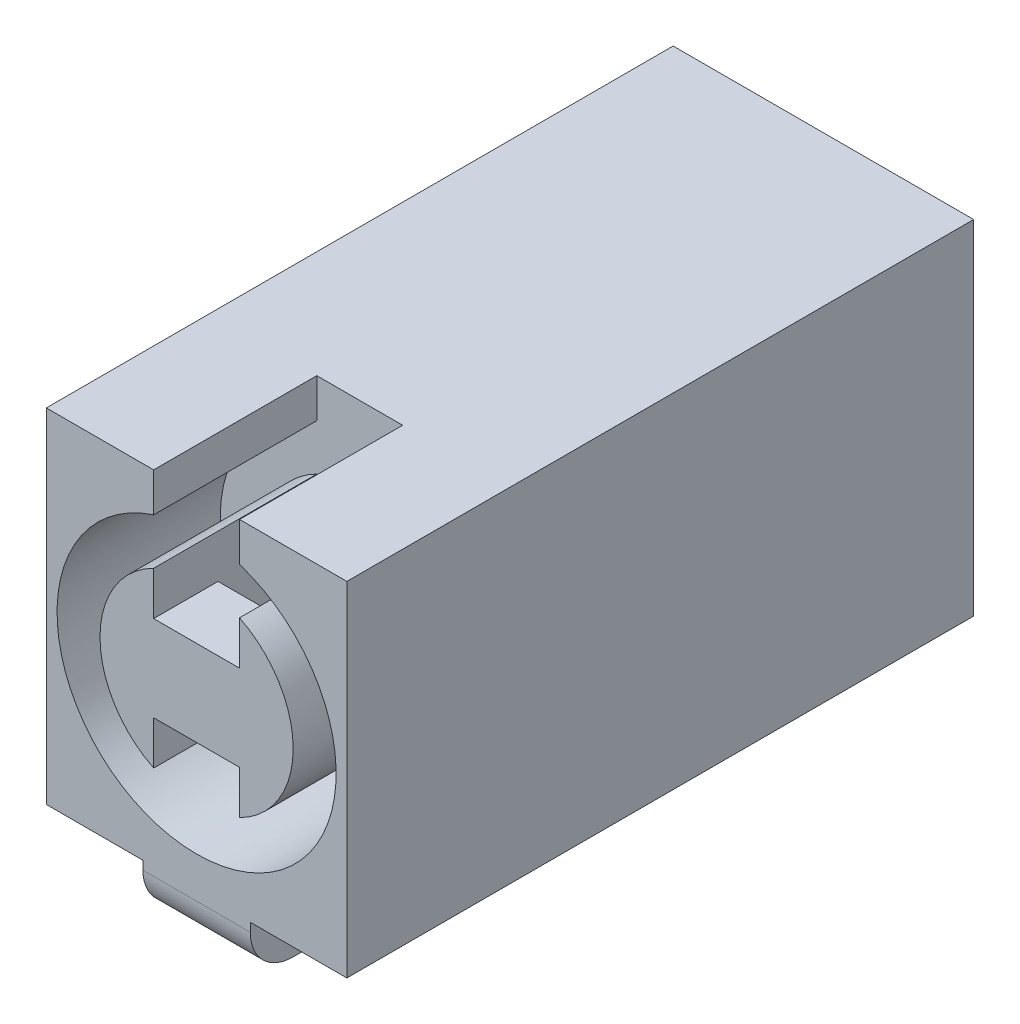
ISO-10303-21;
HEADER;
FILE_DESCRIPTION(('STEP AP214'),'2;1');
FILE_NAME('part.step','',(''),(''),'','','');
FILE_SCHEMA(('AUTOMOTIVE_DESIGN { 1 0 10303 214 1 1 1 1 }'));
ENDSEC;
DATA;
#1=APPLICATION_CONTEXT('core data for automotive mechanical design processes');
#2=APPLICATION_PROTOCOL_DEFINITION('international standard','automotive_design',2000,#1);
#3=PRODUCT_CONTEXT('',#1,'mechanical');
#4=PRODUCT('Part','Part','',(#3));
#5=PRODUCT_RELATED_PRODUCT_CATEGORY('part','',(#4));
#6=PRODUCT_DEFINITION_FORMATION('','',#4);
#7=PRODUCT_DEFINITION_CONTEXT('part definition',#1,'design');
#8=PRODUCT_DEFINITION('design','',#6,#7);
#9=PRODUCT_DEFINITION_SHAPE('','',#8);
#10=(LENGTH_UNIT() NAMED_UNIT(*) SI_UNIT(.MILLI.,.METRE.));
#11=(NAMED_UNIT(*) PLANE_ANGLE_UNIT() SI_UNIT($,.RADIAN.));
#12=(NAMED_UNIT(*) SI_UNIT($,.STERADIAN.) SOLID_ANGLE_UNIT());
#13=UNCERTAINTY_MEASURE_WITH_UNIT(LENGTH_MEASURE(1.E-05),#10,'distance_accuracy_value','');
#14=(GEOMETRIC_REPRESENTATION_CONTEXT(3) GLOBAL_UNCERTAINTY_ASSIGNED_CONTEXT((#13)) GLOBAL_UNIT_ASSIGNED_CONTEXT((#10,
#11,#12)) REPRESENTATION_CONTEXT('',''));
#15=CARTESIAN_POINT('',(0.,0.,0.));
#16=DIRECTION('',(0.,0.,1.));
#17=DIRECTION('',(1.,0.,0.));
#18=AXIS2_PLACEMENT_3D('',#15,#16,#17);
#19=CARTESIAN_POINT('',(2.5,3.5,-9.8));
#20=DIRECTION('',(-1.,0.,0.));
#21=DIRECTION('',(0.,0.,1.));
#22=AXIS2_PLACEMENT_3D('',#19,#20,#21);
#23=PLANE('',#22);
#24=DIRECTION('',(0.,1.,0.));
#25=VECTOR('',#24,1.);
#26=CARTESIAN_POINT('',(2.5,2.5,-7.8));
#27=LINE('',#26,#25);
#28=CARTESIAN_POINT('',(2.5,2.5,-7.8));
#29=VERTEX_POINT('',#28);
#30=CARTESIAN_POINT('',(2.5,3.5,-7.8));
#31=VERTEX_POINT('',#30);
#32=EDGE_CURVE('E498',#29,#31,#27,.T.);
#33=ORIENTED_EDGE('',*,*,#32,.F.);
#34=DIRECTION('',(0.,0.,-1.));
#35=VECTOR('',#34,1.);
#36=CARTESIAN_POINT('',(2.5,2.5,-7.8));
#37=LINE('',#36,#35);
#38=CARTESIAN_POINT('',(2.5,2.5,-6.8));
#39=VERTEX_POINT('',#38);
#40=EDGE_CURVE('E558',#39,#29,#37,.T.);
#41=ORIENTED_EDGE('',*,*,#40,.F.);
#42=DIRECTION('',(0.,1.,0.));
#43=VECTOR('',#42,1.);
#44=CARTESIAN_POINT('',(2.5,2.5,-6.8));
#45=LINE('',#44,#43);
#46=CARTESIAN_POINT('',(2.5,3.5,-6.8));
#47=VERTEX_POINT('',#46);
#48=EDGE_CURVE('E551',#39,#47,#45,.T.);
#49=ORIENTED_EDGE('',*,*,#48,.T.);
#50=DIRECTION('',(0.,0.,-1.));
#51=VECTOR('',#50,1.);
#52=CARTESIAN_POINT('',(2.5,3.5,-9.8));
#53=LINE('',#52,#51);
#54=CARTESIAN_POINT('',(2.5,3.5,-4.8));
#55=VERTEX_POINT('',#54);
#56=EDGE_CURVE('E440',#55,#47,#53,.T.);
#57=ORIENTED_EDGE('',*,*,#56,.F.);
#58=DIRECTION('',(0.,-1.,0.));
#59=VECTOR('',#58,1.);
#60=CARTESIAN_POINT('',(2.5,3.5,-4.8));
#61=LINE('',#60,#59);
#62=CARTESIAN_POINT('',(2.5,0.,-4.8));
#63=VERTEX_POINT('',#62);
#64=EDGE_CURVE('E299',#55,#63,#61,.T.);
#65=ORIENTED_EDGE('',*,*,#64,.T.);
#66=DIRECTION('',(0.,0.,-1.));
#67=VECTOR('',#66,1.);
#68=CARTESIAN_POINT('',(2.5,0.,-9.8));
#69=LINE('',#68,#67);
#70=CARTESIAN_POINT('',(2.5,0.,-9.8));
#71=VERTEX_POINT('',#70);
#72=EDGE_CURVE('E435',#63,#71,#69,.T.);
#73=ORIENTED_EDGE('',*,*,#72,.T.);
#74=DIRECTION('',(0.,-1.,0.));
#75=VECTOR('',#74,1.);
#76=CARTESIAN_POINT('',(2.5,3.5,-9.8));
#77=LINE('',#76,#75);
#78=CARTESIAN_POINT('',(2.5,3.5,-9.8));
#79=VERTEX_POINT('',#78);
#80=EDGE_CURVE('E453',#79,#71,#77,.T.);
#81=ORIENTED_EDGE('',*,*,#80,.F.);
#82=EDGE_CURVE('E443',#31,#79,#53,.T.);
#83=ORIENTED_EDGE('',*,*,#82,.F.);
#84=EDGE_LOOP('',(#33,#41,#49,#57,#65,#73,#81,#83));
#85=FACE_BOUND('',#84,.T.);
#86=ADVANCED_FACE('F38',(#85),#23,.F.);
#87=CARTESIAN_POINT('',(4.5,3.5,-9.8));
#88=DIRECTION('',(1.,0.,0.));
#89=DIRECTION('',(0.,0.,-1.));
#90=AXIS2_PLACEMENT_3D('',#87,#88,#89);
#91=PLANE('',#90);
#92=DIRECTION('',(0.,1.,0.));
#93=VECTOR('',#92,1.);
#94=CARTESIAN_POINT('',(4.5,2.5,-7.8));
#95=LINE('',#94,#93);
#96=CARTESIAN_POINT('',(4.5,2.5,-7.8));
#97=VERTEX_POINT('',#96);
#98=CARTESIAN_POINT('',(4.5,3.5,-7.8));
#99=VERTEX_POINT('',#98);
#100=EDGE_CURVE('E501',#97,#99,#95,.T.);
#101=ORIENTED_EDGE('',*,*,#100,.T.);
#102=DIRECTION('',(0.,0.,1.));
#103=VECTOR('',#102,1.);
#104=CARTESIAN_POINT('',(4.5,3.5,-9.8));
#105=LINE('',#104,#103);
#106=CARTESIAN_POINT('',(4.5,3.5,-9.8));
#107=VERTEX_POINT('',#106);
#108=EDGE_CURVE('E447',#107,#99,#105,.T.);
#109=ORIENTED_EDGE('',*,*,#108,.F.);
#110=DIRECTION('',(0.,-1.,0.));
#111=VECTOR('',#110,1.);
#112=CARTESIAN_POINT('',(4.5,3.5,-9.8));
#113=LINE('',#112,#111);
#114=CARTESIAN_POINT('',(4.5,0.,-9.8));
#115=VERTEX_POINT('',#114);
#116=EDGE_CURVE('E463',#107,#115,#113,.T.);
#117=ORIENTED_EDGE('',*,*,#116,.T.);
#118=DIRECTION('',(0.,0.,1.));
#119=VECTOR('',#118,1.);
#120=CARTESIAN_POINT('',(4.5,0.,-9.8));
#121=LINE('',#120,#119);
#122=CARTESIAN_POINT('',(4.5,0.,-4.8));
#123=VERTEX_POINT('',#122);
#124=EDGE_CURVE('E456',#115,#123,#121,.T.);
#125=ORIENTED_EDGE('',*,*,#124,.T.);
#126=DIRECTION('',(0.,-1.,0.));
#127=VECTOR('',#126,1.);
#128=CARTESIAN_POINT('',(4.5,3.5,-4.8));
#129=LINE('',#128,#127);
#130=CARTESIAN_POINT('',(4.5,3.5,-4.8));
#131=VERTEX_POINT('',#130);
#132=EDGE_CURVE('E460',#131,#123,#129,.T.);
#133=ORIENTED_EDGE('',*,*,#132,.F.);
#134=CARTESIAN_POINT('',(4.5,3.5,-6.8));
#135=VERTEX_POINT('',#134);
#136=EDGE_CURVE('E446',#135,#131,#105,.T.);
#137=ORIENTED_EDGE('',*,*,#136,.F.);
#138=DIRECTION('',(0.,1.,0.));
#139=VECTOR('',#138,1.);
#140=CARTESIAN_POINT('',(4.5,2.5,-6.8));
#141=LINE('',#140,#139);
#142=CARTESIAN_POINT('',(4.5,2.5,-6.8));
#143=VERTEX_POINT('',#142);
#144=EDGE_CURVE('E548',#143,#135,#141,.T.);
#145=ORIENTED_EDGE('',*,*,#144,.F.);
#146=DIRECTION('',(0.,0.,1.));
#147=VECTOR('',#146,1.);
#148=CARTESIAN_POINT('',(4.5,2.5,-7.8));
#149=LINE('',#148,#147);
#150=EDGE_CURVE('E565',#97,#143,#149,.T.);
#151=ORIENTED_EDGE('',*,*,#150,.F.);
#152=EDGE_LOOP('',(#101,#109,#117,#125,#133,#137,#145,#151));
#153=FACE_BOUND('',#152,.T.);
#154=ADVANCED_FACE('F538',(#153),#91,.F.);
#155=CARTESIAN_POINT('',(0.,3.5,0.));
#156=DIRECTION('',(0.,1.,0.));
#157=DIRECTION('',(0.,0.,1.));
#158=AXIS2_PLACEMENT_3D('',#155,#156,#157);
#159=PLANE('',#158);
#160=DIRECTION('',(1.,0.,0.));
#161=VECTOR('',#160,1.);
#162=CARTESIAN_POINT('',(2.5,3.5,-7.8));
#163=LINE('',#162,#161);
#164=EDGE_CURVE('E559',#31,#99,#163,.T.);
#165=ORIENTED_EDGE('',*,*,#164,.F.);
#166=ORIENTED_EDGE('',*,*,#82,.T.);
#167=DIRECTION('',(1.,0.,0.));
#168=VECTOR('',#167,1.);
#169=CARTESIAN_POINT('',(2.5,3.5,-9.8));
#170=LINE('',#169,#168);
#171=EDGE_CURVE('E442',#79,#107,#170,.T.);
#172=ORIENTED_EDGE('',*,*,#171,.T.);
#173=ORIENTED_EDGE('',*,*,#108,.T.);
#174=EDGE_LOOP('',(#165,#166,#172,#173));
#175=FACE_BOUND('',#174,.T.);
#176=ADVANCED_FACE('F607',(#175),#159,.F.);
#177=DIRECTION('',(-1.,0.,0.));
#178=VECTOR('',#177,1.);
#179=CARTESIAN_POINT('',(2.5,3.5,-6.8));
#180=LINE('',#179,#178);
#181=EDGE_CURVE('E555',#135,#47,#180,.T.);
#182=ORIENTED_EDGE('',*,*,#181,.F.);
#183=ORIENTED_EDGE('',*,*,#136,.T.);
#184=DIRECTION('',(-1.,0.,0.));
#185=VECTOR('',#184,1.);
#186=CARTESIAN_POINT('',(2.5,3.5,-4.8));
#187=LINE('',#186,#185);
#188=EDGE_CURVE('E450',#131,#55,#187,.T.);
#189=ORIENTED_EDGE('',*,*,#188,.T.);
#190=ORIENTED_EDGE('',*,*,#56,.T.);
#191=EDGE_LOOP('',(#182,#183,#189,#190));
#192=FACE_BOUND('',#191,.T.);
#193=ADVANCED_FACE('F615',(#192),#159,.F.);
#194=CARTESIAN_POINT('',(0.,0.,0.));
#195=DIRECTION('',(0.,-1.,0.));
#196=DIRECTION('',(0.,0.,-1.));
#197=AXIS2_PLACEMENT_3D('',#194,#195,#196);
#198=PLANE('',#197);
#199=DIRECTION('',(-1.,0.,0.));
#200=VECTOR('',#199,1.);
#201=CARTESIAN_POINT('',(0.,0.,-14.6));
#202=LINE('',#201,#200);
#203=CARTESIAN_POINT('',(2.25,0.,-14.6));
#204=VERTEX_POINT('',#203);
#205=CARTESIAN_POINT('',(0.,0.,-14.6));
#206=VERTEX_POINT('',#205);
#207=EDGE_CURVE('E305',#204,#206,#202,.T.);
#208=ORIENTED_EDGE('',*,*,#207,.F.);
#209=DIRECTION('',(0.,0.,-1.));
#210=VECTOR('',#209,1.);
#211=CARTESIAN_POINT('',(2.25,0.,-9.8));
#212=LINE('',#211,#210);
#213=CARTESIAN_POINT('',(2.25,0.,-9.8));
#214=VERTEX_POINT('',#213);
#215=EDGE_CURVE('E495',#214,#204,#212,.T.);
#216=ORIENTED_EDGE('',*,*,#215,.F.);
#217=DIRECTION('',(-1.,0.,0.));
#218=VECTOR('',#217,1.);
#219=CARTESIAN_POINT('',(2.25,0.,-9.8));
#220=LINE('',#219,#218);
#221=EDGE_CURVE('E471',#71,#214,#220,.T.);
#222=ORIENTED_EDGE('',*,*,#221,.F.);
#223=ORIENTED_EDGE('',*,*,#72,.F.);
#224=DIRECTION('',(1.,0.,0.));
#225=VECTOR('',#224,1.);
#226=CARTESIAN_POINT('',(2.25,0.,-4.8));
#227=LINE('',#226,#225);
#228=CARTESIAN_POINT('',(2.25,0.,-4.8));
#229=VERTEX_POINT('',#228);
#230=EDGE_CURVE('E371',#229,#63,#227,.T.);
#231=ORIENTED_EDGE('',*,*,#230,.F.);
#232=DIRECTION('',(0.,0.,-1.));
#233=VECTOR('',#232,1.);
#234=CARTESIAN_POINT('',(2.25,0.,-4.8));
#235=LINE('',#234,#233);
#236=CARTESIAN_POINT('',(2.25,0.,0.));
#237=VERTEX_POINT('',#236);
#238=EDGE_CURVE('E369',#237,#229,#235,.T.);
#239=ORIENTED_EDGE('',*,*,#238,.F.);
#240=DIRECTION('',(1.,0.,0.));
#241=VECTOR('',#240,1.);
#242=CARTESIAN_POINT('',(0.,0.,0.));
#243=LINE('',#242,#241);
#244=CARTESIAN_POINT('',(0.,0.,0.));
#245=VERTEX_POINT('',#244);
#246=EDGE_CURVE('E300',#245,#237,#243,.T.);
#247=ORIENTED_EDGE('',*,*,#246,.F.);
#248=DIRECTION('',(0.,0.,1.));
#249=VECTOR('',#248,1.);
#250=CARTESIAN_POINT('',(0.,0.,0.));
#251=LINE('',#250,#249);
#252=EDGE_CURVE('E295',#206,#245,#251,.T.);
#253=ORIENTED_EDGE('',*,*,#252,.F.);
#254=EDGE_LOOP('',(#208,#216,#222,#223,#231,#239,#247,#253));
#255=FACE_BOUND('',#254,.T.);
#256=ADVANCED_FACE('F480',(#255),#198,.T.);
#257=CARTESIAN_POINT('',(4.75,0.,-9.8));
#258=VERTEX_POINT('',#257);
#259=EDGE_CURVE('E507',#258,#115,#220,.T.);
#260=ORIENTED_EDGE('',*,*,#259,.F.);
#261=DIRECTION('',(0.,0.,1.));
#262=VECTOR('',#261,1.);
#263=CARTESIAN_POINT('',(4.75,0.,-9.8));
#264=LINE('',#263,#262);
#265=CARTESIAN_POINT('',(4.75,0.,-14.6));
#266=VERTEX_POINT('',#265);
#267=EDGE_CURVE('E497',#266,#258,#264,.T.);
#268=ORIENTED_EDGE('',*,*,#267,.F.);
#269=CARTESIAN_POINT('',(7.,0.,-14.6));
#270=VERTEX_POINT('',#269);
#271=EDGE_CURVE('E306',#270,#266,#202,.T.);
#272=ORIENTED_EDGE('',*,*,#271,.F.);
#273=DIRECTION('',(0.,0.,-1.));
#274=VECTOR('',#273,1.);
#275=CARTESIAN_POINT('',(7.,0.,0.));
#276=LINE('',#275,#274);
#277=CARTESIAN_POINT('',(7.,0.,0.));
#278=VERTEX_POINT('',#277);
#279=EDGE_CURVE('E303',#278,#270,#276,.T.);
#280=ORIENTED_EDGE('',*,*,#279,.F.);
#281=CARTESIAN_POINT('',(4.75,0.,0.));
#282=VERTEX_POINT('',#281);
#283=EDGE_CURVE('E298',#282,#278,#243,.T.);
#284=ORIENTED_EDGE('',*,*,#283,.F.);
#285=DIRECTION('',(0.,0.,1.));
#286=VECTOR('',#285,1.);
#287=CARTESIAN_POINT('',(4.75,0.,-4.8));
#288=LINE('',#287,#286);
#289=CARTESIAN_POINT('',(4.75,0.,-4.8));
#290=VERTEX_POINT('',#289);
#291=EDGE_CURVE('E375',#290,#282,#288,.T.);
#292=ORIENTED_EDGE('',*,*,#291,.F.);
#293=EDGE_CURVE('E326',#123,#290,#227,.T.);
#294=ORIENTED_EDGE('',*,*,#293,.F.);
#295=ORIENTED_EDGE('',*,*,#124,.F.);
#296=EDGE_LOOP('',(#260,#268,#272,#280,#284,#292,#294,#295));
#297=FACE_BOUND('',#296,.T.);
#298=ADVANCED_FACE('F526',(#297),#198,.T.);
#299=CARTESIAN_POINT('',(4.5,7.09232921921324,-3.8));
#300=DIRECTION('',(1.,0.,0.));
#301=DIRECTION('',(0.,1.,0.));
#302=AXIS2_PLACEMENT_3D('',#299,#300,#301);
#303=PLANE('',#302);
#304=DIRECTION('',(0.,0.,1.));
#305=VECTOR('',#304,1.);
#306=CARTESIAN_POINT('',(4.5,5.,0.));
#307=LINE('',#306,#305);
#308=CARTESIAN_POINT('',(4.5,5.,-1.5));
#309=VERTEX_POINT('',#308);
#310=CARTESIAN_POINT('',(4.5,5.,0.));
#311=VERTEX_POINT('',#310);
#312=EDGE_CURVE('E389',#309,#311,#307,.T.);
#313=ORIENTED_EDGE('',*,*,#312,.T.);
#314=DIRECTION('',(0.,-1.,0.));
#315=VECTOR('',#314,1.);
#316=CARTESIAN_POINT('',(4.5,8.,0.));
#317=LINE('',#316,#315);
#318=CARTESIAN_POINT('',(4.5,6.01556443707464,0.));
#319=VERTEX_POINT('',#318);
#320=EDGE_CURVE('E324',#319,#311,#317,.T.);
#321=ORIENTED_EDGE('',*,*,#320,.F.);
#322=DIRECTION('',(0.,0.,1.));
#323=VECTOR('',#322,1.);
#324=CARTESIAN_POINT('',(4.5,6.01556443707464,-3.8));
#325=LINE('',#324,#323);
#326=CARTESIAN_POINT('',(4.5,6.01556443707464,-3.8));
#327=VERTEX_POINT('',#326);
#328=EDGE_CURVE('E424',#319,#327,#325,.F.);
#329=ORIENTED_EDGE('',*,*,#328,.T.);
#330=DIRECTION('',(0.,1.,0.));
#331=VECTOR('',#330,1.);
#332=CARTESIAN_POINT('',(4.5,7.09232921921324,-3.8));
#333=LINE('',#332,#331);
#334=CARTESIAN_POINT('',(4.5,1.98443556292536,-3.8));
#335=VERTEX_POINT('',#334);
#336=EDGE_CURVE('E411',#335,#327,#333,.T.);
#337=ORIENTED_EDGE('',*,*,#336,.F.);
#338=DIRECTION('',(0.,0.,1.));
#339=VECTOR('',#338,1.);
#340=CARTESIAN_POINT('',(4.5,1.98443556292536,-3.8));
#341=LINE('',#340,#339);
#342=CARTESIAN_POINT('',(4.5,1.98443556292536,0.));
#343=VERTEX_POINT('',#342);
#344=EDGE_CURVE('E421',#335,#343,#341,.T.);
#345=ORIENTED_EDGE('',*,*,#344,.T.);
#346=CARTESIAN_POINT('',(4.5,3.,0.));
#347=VERTEX_POINT('',#346);
#348=EDGE_CURVE('E323',#347,#343,#317,.T.);
#349=ORIENTED_EDGE('',*,*,#348,.F.);
#350=DIRECTION('',(0.,0.,-1.));
#351=VECTOR('',#350,1.);
#352=CARTESIAN_POINT('',(4.5,3.,0.));
#353=LINE('',#352,#351);
#354=CARTESIAN_POINT('',(4.5,3.,-1.5));
#355=VERTEX_POINT('',#354);
#356=EDGE_CURVE('E384',#347,#355,#353,.T.);
#357=ORIENTED_EDGE('',*,*,#356,.T.);
#358=DIRECTION('',(0.,1.,0.));
#359=VECTOR('',#358,1.);
#360=CARTESIAN_POINT('',(4.5,5.,-1.5));
#361=LINE('',#360,#359);
#362=EDGE_CURVE('E386',#355,#309,#361,.T.);
#363=ORIENTED_EDGE('',*,*,#362,.T.);
#364=EDGE_LOOP('',(#313,#321,#329,#337,#345,#349,#357,#363));
#365=FACE_BOUND('',#364,.T.);
#366=ADVANCED_FACE('F674',(#365),#303,.F.);
#367=CARTESIAN_POINT('',(2.5,7.09232921921324,-3.8));
#368=DIRECTION('',(-1.,0.,0.));
#369=DIRECTION('',(0.,-1.,0.));
#370=AXIS2_PLACEMENT_3D('',#367,#368,#369);
#371=PLANE('',#370);
#372=DIRECTION('',(0.,0.,1.));
#373=VECTOR('',#372,1.);
#374=CARTESIAN_POINT('',(2.5,1.98443556292536,-3.8));
#375=LINE('',#374,#373);
#376=CARTESIAN_POINT('',(2.5,1.98443556292536,0.));
#377=VERTEX_POINT('',#376);
#378=CARTESIAN_POINT('',(2.5,1.98443556292536,-3.8));
#379=VERTEX_POINT('',#378);
#380=EDGE_CURVE('E418',#377,#379,#375,.F.);
#381=ORIENTED_EDGE('',*,*,#380,.T.);
#382=DIRECTION('',(0.,-1.,0.));
#383=VECTOR('',#382,1.);
#384=CARTESIAN_POINT('',(2.5,7.09232921921324,-3.8));
#385=LINE('',#384,#383);
#386=CARTESIAN_POINT('',(2.5,6.01556443707464,-3.8));
#387=VERTEX_POINT('',#386);
#388=EDGE_CURVE('E413',#387,#379,#385,.T.);
#389=ORIENTED_EDGE('',*,*,#388,.F.);
#390=DIRECTION('',(0.,0.,1.));
#391=VECTOR('',#390,1.);
#392=CARTESIAN_POINT('',(2.5,6.01556443707464,-3.8));
#393=LINE('',#392,#391);
#394=CARTESIAN_POINT('',(2.5,6.01556443707464,0.));
#395=VERTEX_POINT('',#394);
#396=EDGE_CURVE('E415',#387,#395,#393,.T.);
#397=ORIENTED_EDGE('',*,*,#396,.T.);
#398=DIRECTION('',(0.,1.,0.));
#399=VECTOR('',#398,1.);
#400=CARTESIAN_POINT('',(2.5,8.,0.));
#401=LINE('',#400,#399);
#402=CARTESIAN_POINT('',(2.5,5.,0.));
#403=VERTEX_POINT('',#402);
#404=EDGE_CURVE('E319',#403,#395,#401,.T.);
#405=ORIENTED_EDGE('',*,*,#404,.F.);
#406=DIRECTION('',(0.,0.,1.));
#407=VECTOR('',#406,1.);
#408=CARTESIAN_POINT('',(2.5,5.,0.));
#409=LINE('',#408,#407);
#410=CARTESIAN_POINT('',(2.5,5.,-1.5));
#411=VERTEX_POINT('',#410);
#412=EDGE_CURVE('E387',#411,#403,#409,.T.);
#413=ORIENTED_EDGE('',*,*,#412,.F.);
#414=DIRECTION('',(0.,1.,0.));
#415=VECTOR('',#414,1.);
#416=CARTESIAN_POINT('',(2.5,5.,-1.5));
#417=LINE('',#416,#415);
#418=CARTESIAN_POINT('',(2.5,3.,-1.5));
#419=VERTEX_POINT('',#418);
#420=EDGE_CURVE('E395',#419,#411,#417,.T.);
#421=ORIENTED_EDGE('',*,*,#420,.F.);
#422=DIRECTION('',(0.,0.,-1.));
#423=VECTOR('',#422,1.);
#424=CARTESIAN_POINT('',(2.5,3.,0.));
#425=LINE('',#424,#423);
#426=CARTESIAN_POINT('',(2.5,3.,0.));
#427=VERTEX_POINT('',#426);
#428=EDGE_CURVE('E383',#427,#419,#425,.T.);
#429=ORIENTED_EDGE('',*,*,#428,.F.);
#430=EDGE_CURVE('E320',#377,#427,#401,.T.);
#431=ORIENTED_EDGE('',*,*,#430,.F.);
#432=EDGE_LOOP('',(#381,#389,#397,#405,#413,#421,#429,#431));
#433=FACE_BOUND('',#432,.T.);
#434=ADVANCED_FACE('F671',(#433),#371,.F.);
#435=CARTESIAN_POINT('',(3.5,4.,-3.8));
#436=DIRECTION('',(0.,0.,1.));
#437=DIRECTION('',(1.,0.,0.));
#438=AXIS2_PLACEMENT_3D('',#435,#436,#437);
#439=CYLINDRICAL_SURFACE('',#438,2.25);
#440=ORIENTED_EDGE('',*,*,#328,.F.);
#441=CARTESIAN_POINT('',(3.5,4.,0.));
#442=DIRECTION('',(0.,0.,1.));
#443=DIRECTION('',(1.,0.,0.));
#444=AXIS2_PLACEMENT_3D('',#441,#442,#443);
#445=CIRCLE('',#444,2.25);
#446=EDGE_CURVE('E427',#343,#319,#445,.T.);
#447=ORIENTED_EDGE('',*,*,#446,.F.);
#448=ORIENTED_EDGE('',*,*,#344,.F.);
#449=CARTESIAN_POINT('',(3.5,4.,-3.8));
#450=DIRECTION('',(0.,0.,1.));
#451=DIRECTION('',(1.,0.,0.));
#452=AXIS2_PLACEMENT_3D('',#449,#450,#451);
#453=CIRCLE('',#452,2.25);
#454=EDGE_CURVE('E428',#335,#327,#453,.T.);
#455=ORIENTED_EDGE('',*,*,#454,.T.);
#456=EDGE_LOOP('',(#440,#447,#448,#455));
#457=FACE_BOUND('',#456,.T.);
#458=ADVANCED_FACE('F601',(#457),#439,.T.);
#459=CARTESIAN_POINT('',(0.,8.,0.));
#460=DIRECTION('',(1.,0.,0.));
#461=DIRECTION('',(0.,0.,-1.));
#462=AXIS2_PLACEMENT_3D('',#459,#460,#461);
#463=PLANE('',#462);
#464=ORIENTED_EDGE('',*,*,#252,.T.);
#465=DIRECTION('',(0.,-1.,0.));
#466=VECTOR('',#465,1.);
#467=CARTESIAN_POINT('',(0.,8.,0.));
#468=LINE('',#467,#466);
#469=CARTESIAN_POINT('',(0.,8.,0.));
#470=VERTEX_POINT('',#469);
#471=EDGE_CURVE('E317',#470,#245,#468,.T.);
#472=ORIENTED_EDGE('',*,*,#471,.F.);
#473=DIRECTION('',(0.,0.,1.));
#474=VECTOR('',#473,1.);
#475=CARTESIAN_POINT('',(0.,8.,0.));
#476=LINE('',#475,#474);
#477=CARTESIAN_POINT('',(0.,8.,-14.6));
#478=VERTEX_POINT('',#477);
#479=EDGE_CURVE('E283',#478,#470,#476,.T.);
#480=ORIENTED_EDGE('',*,*,#479,.F.);
#481=DIRECTION('',(0.,-1.,0.));
#482=VECTOR('',#481,1.);
#483=CARTESIAN_POINT('',(0.,8.,-14.6));
#484=LINE('',#483,#482);
#485=EDGE_CURVE('E294',#478,#206,#484,.T.);
#486=ORIENTED_EDGE('',*,*,#485,.T.);
#487=EDGE_LOOP('',(#464,#472,#480,#486));
#488=FACE_BOUND('',#487,.T.);
#489=ADVANCED_FACE('F487',(#488),#463,.F.);
#490=CARTESIAN_POINT('',(0.,8.,0.));
#491=DIRECTION('',(0.,0.,-1.));
#492=DIRECTION('',(-1.,0.,0.));
#493=AXIS2_PLACEMENT_3D('',#490,#491,#492);
#494=PLANE('',#493);
#495=CARTESIAN_POINT('',(3.5,4.,0.));
#496=DIRECTION('',(0.,0.,1.));
#497=DIRECTION('',(1.,0.,0.));
#498=AXIS2_PLACEMENT_3D('',#495,#496,#497);
#499=CIRCLE('',#498,3.25);
#500=CARTESIAN_POINT('',(2.5,7.09232921921324,0.));
#501=VERTEX_POINT('',#500);
#502=CARTESIAN_POINT('',(4.5,7.09232921921324,0.));
#503=VERTEX_POINT('',#502);
#504=EDGE_CURVE('E277',#501,#503,#499,.T.);
#505=ORIENTED_EDGE('',*,*,#504,.F.);
#506=DIRECTION('',(0.,1.,0.));
#507=VECTOR('',#506,1.);
#508=CARTESIAN_POINT('',(2.5,6.,0.));
#509=LINE('',#508,#507);
#510=CARTESIAN_POINT('',(2.5,8.,0.));
#511=VERTEX_POINT('',#510);
#512=EDGE_CURVE('E260',#501,#511,#509,.T.);
#513=ORIENTED_EDGE('',*,*,#512,.T.);
#514=DIRECTION('',(1.,0.,0.));
#515=VECTOR('',#514,1.);
#516=CARTESIAN_POINT('',(0.,8.,0.));
#517=LINE('',#516,#515);
#518=EDGE_CURVE('E273',#470,#511,#517,.T.);
#519=ORIENTED_EDGE('',*,*,#518,.F.);
#520=ORIENTED_EDGE('',*,*,#471,.T.);
#521=ORIENTED_EDGE('',*,*,#246,.T.);
#522=DIRECTION('',(0.,1.,0.));
#523=VECTOR('',#522,1.);
#524=CARTESIAN_POINT('',(2.25,-1.2,0.));
#525=LINE('',#524,#523);
#526=CARTESIAN_POINT('',(2.25,-0.2,0.));
#527=VERTEX_POINT('',#526);
#528=EDGE_CURVE('E344',#527,#237,#525,.T.);
#529=ORIENTED_EDGE('',*,*,#528,.F.);
#530=DIRECTION('',(-1.,0.,0.));
#531=VECTOR('',#530,1.);
#532=CARTESIAN_POINT('',(0.,-0.200000000000001,0.));
#533=LINE('',#532,#531);
#534=CARTESIAN_POINT('',(4.75,-0.2,0.));
#535=VERTEX_POINT('',#534);
#536=EDGE_CURVE('E46',#527,#535,#533,.F.);
#537=ORIENTED_EDGE('',*,*,#536,.T.);
#538=DIRECTION('',(0.,1.,0.));
#539=VECTOR('',#538,1.);
#540=CARTESIAN_POINT('',(4.75,-1.2,0.));
#541=LINE('',#540,#539);
#542=EDGE_CURVE('E350',#535,#282,#541,.T.);
#543=ORIENTED_EDGE('',*,*,#542,.T.);
#544=ORIENTED_EDGE('',*,*,#283,.T.);
#545=DIRECTION('',(0.,-1.,0.));
#546=VECTOR('',#545,1.);
#547=CARTESIAN_POINT('',(7.,8.,0.));
#548=LINE('',#547,#546);
#549=CARTESIAN_POINT('',(7.,8.,0.));
#550=VERTEX_POINT('',#549);
#551=EDGE_CURVE('E314',#550,#278,#548,.T.);
#552=ORIENTED_EDGE('',*,*,#551,.F.);
#553=CARTESIAN_POINT('',(4.5,8.,0.));
#554=VERTEX_POINT('',#553);
#555=EDGE_CURVE('E286',#554,#550,#517,.T.);
#556=ORIENTED_EDGE('',*,*,#555,.F.);
#557=DIRECTION('',(0.,1.,0.));
#558=VECTOR('',#557,1.);
#559=CARTESIAN_POINT('',(4.5,6.,0.));
#560=LINE('',#559,#558);
#561=EDGE_CURVE('E278',#503,#554,#560,.T.);
#562=ORIENTED_EDGE('',*,*,#561,.F.);
#563=EDGE_LOOP('',(#505,#513,#519,#520,#521,#529,#537,#543,#544,#552,#556,#562));
#564=FACE_BOUND('',#563,.T.);
#565=ADVANCED_FACE('F271',(#564),#494,.F.);
#566=CARTESIAN_POINT('',(7.,8.,0.));
#567=DIRECTION('',(-1.,0.,0.));
#568=DIRECTION('',(0.,0.,1.));
#569=AXIS2_PLACEMENT_3D('',#566,#567,#568);
#570=PLANE('',#569);
#571=ORIENTED_EDGE('',*,*,#279,.T.);
#572=DIRECTION('',(0.,-1.,0.));
#573=VECTOR('',#572,1.);
#574=CARTESIAN_POINT('',(7.,8.,-14.6));
#575=LINE('',#574,#573);
#576=CARTESIAN_POINT('',(7.,8.,-14.6));
#577=VERTEX_POINT('',#576);
#578=EDGE_CURVE('E311',#577,#270,#575,.T.);
#579=ORIENTED_EDGE('',*,*,#578,.F.);
#580=DIRECTION('',(0.,0.,-1.));
#581=VECTOR('',#580,1.);
#582=CARTESIAN_POINT('',(7.,8.,0.));
#583=LINE('',#582,#581);
#584=EDGE_CURVE('E285',#550,#577,#583,.T.);
#585=ORIENTED_EDGE('',*,*,#584,.F.);
#586=ORIENTED_EDGE('',*,*,#551,.T.);
#587=EDGE_LOOP('',(#571,#579,#585,#586));
#588=FACE_BOUND('',#587,.T.);
#589=ADVANCED_FACE('F532',(#588),#570,.F.);
#590=CARTESIAN_POINT('',(0.,8.,-14.6));
#591=DIRECTION('',(0.,0.,1.));
#592=DIRECTION('',(1.,0.,0.));
#593=AXIS2_PLACEMENT_3D('',#590,#591,#592);
#594=PLANE('',#593);
#595=DIRECTION('',(0.,1.,0.));
#596=VECTOR('',#595,1.);
#597=CARTESIAN_POINT('',(4.75,-1.2,-14.6));
#598=LINE('',#597,#596);
#599=CARTESIAN_POINT('',(4.75,-0.2,-14.6));
#600=VERTEX_POINT('',#599);
#601=EDGE_CURVE('E515',#600,#266,#598,.T.);
#602=ORIENTED_EDGE('',*,*,#601,.F.);
#603=DIRECTION('',(1.,0.,0.));
#604=VECTOR('',#603,1.);
#605=CARTESIAN_POINT('',(2.25,-0.2,-14.6));
#606=LINE('',#605,#604);
#607=CARTESIAN_POINT('',(2.25,-0.2,-14.6));
#608=VERTEX_POINT('',#607);
#609=EDGE_CURVE('E332',#600,#608,#606,.F.);
#610=ORIENTED_EDGE('',*,*,#609,.T.);
#611=DIRECTION('',(0.,1.,0.));
#612=VECTOR('',#611,1.);
#613=CARTESIAN_POINT('',(2.25,-1.2,-14.6));
#614=LINE('',#613,#612);
#615=EDGE_CURVE('E372',#608,#204,#614,.T.);
#616=ORIENTED_EDGE('',*,*,#615,.T.);
#617=ORIENTED_EDGE('',*,*,#207,.T.);
#618=ORIENTED_EDGE('',*,*,#485,.F.);
#619=DIRECTION('',(-1.,0.,0.));
#620=VECTOR('',#619,1.);
#621=CARTESIAN_POINT('',(0.,8.,-14.6));
#622=LINE('',#621,#620);
#623=EDGE_CURVE('E288',#577,#478,#622,.T.);
#624=ORIENTED_EDGE('',*,*,#623,.F.);
#625=ORIENTED_EDGE('',*,*,#578,.T.);
#626=ORIENTED_EDGE('',*,*,#271,.T.);
#627=EDGE_LOOP('',(#602,#610,#616,#617,#618,#624,#625,#626));
#628=FACE_BOUND('',#627,.T.);
#629=ADVANCED_FACE('F492',(#628),#594,.F.);
#630=CARTESIAN_POINT('',(0.,8.,0.));
#631=DIRECTION('',(0.,-1.,0.));
#632=DIRECTION('',(0.,0.,-1.));
#633=AXIS2_PLACEMENT_3D('',#630,#631,#632);
#634=PLANE('',#633);
#635=ORIENTED_EDGE('',*,*,#518,.T.);
#636=DIRECTION('',(0.,0.,1.));
#637=VECTOR('',#636,1.);
#638=CARTESIAN_POINT('',(2.5,8.,0.));
#639=LINE('',#638,#637);
#640=CARTESIAN_POINT('',(2.5,8.,-3.8));
#641=VERTEX_POINT('',#640);
#642=EDGE_CURVE('E257',#641,#511,#639,.T.);
#643=ORIENTED_EDGE('',*,*,#642,.F.);
#644=DIRECTION('',(-1.,0.,0.));
#645=VECTOR('',#644,1.);
#646=CARTESIAN_POINT('',(2.5,8.,-3.8));
#647=LINE('',#646,#645);
#648=CARTESIAN_POINT('',(4.5,8.,-3.8));
#649=VERTEX_POINT('',#648);
#650=EDGE_CURVE('E279',#649,#641,#647,.T.);
#651=ORIENTED_EDGE('',*,*,#650,.F.);
#652=DIRECTION('',(0.,0.,-1.));
#653=VECTOR('',#652,1.);
#654=CARTESIAN_POINT('',(4.5,8.,0.));
#655=LINE('',#654,#653);
#656=EDGE_CURVE('E268',#554,#649,#655,.T.);
#657=ORIENTED_EDGE('',*,*,#656,.F.);
#658=ORIENTED_EDGE('',*,*,#555,.T.);
#659=ORIENTED_EDGE('',*,*,#584,.T.);
#660=ORIENTED_EDGE('',*,*,#623,.T.);
#661=ORIENTED_EDGE('',*,*,#479,.T.);
#662=EDGE_LOOP('',(#635,#643,#651,#657,#658,#659,#660,#661));
#663=FACE_BOUND('',#662,.T.);
#664=ADVANCED_FACE('F281',(#663),#634,.F.);
#665=CARTESIAN_POINT('',(2.5,3.5,-4.8));
#666=DIRECTION('',(0.,0.,1.));
#667=DIRECTION('',(1.,0.,0.));
#668=AXIS2_PLACEMENT_3D('',#665,#666,#667);
#669=PLANE('',#668);
#670=ORIENTED_EDGE('',*,*,#132,.T.);
#671=ORIENTED_EDGE('',*,*,#293,.T.);
#672=DIRECTION('',(0.,1.,0.));
#673=VECTOR('',#672,1.);
#674=CARTESIAN_POINT('',(4.75,-1.2,-4.8));
#675=LINE('',#674,#673);
#676=CARTESIAN_POINT('',(4.75,-1.2,-4.8));
#677=VERTEX_POINT('',#676);
#678=EDGE_CURVE('E378',#677,#290,#675,.T.);
#679=ORIENTED_EDGE('',*,*,#678,.F.);
#680=DIRECTION('',(1.,0.,0.));
#681=VECTOR('',#680,1.);
#682=CARTESIAN_POINT('',(2.25,-1.2,-4.8));
#683=LINE('',#682,#681);
#684=CARTESIAN_POINT('',(2.25,-1.2,-4.8));
#685=VERTEX_POINT('',#684);
#686=EDGE_CURVE('E363',#685,#677,#683,.T.);
#687=ORIENTED_EDGE('',*,*,#686,.F.);
#688=DIRECTION('',(0.,1.,0.));
#689=VECTOR('',#688,1.);
#690=CARTESIAN_POINT('',(2.25,-1.2,-4.8));
#691=LINE('',#690,#689);
#692=EDGE_CURVE('E380',#685,#229,#691,.T.);
#693=ORIENTED_EDGE('',*,*,#692,.T.);
#694=ORIENTED_EDGE('',*,*,#230,.T.);
#695=ORIENTED_EDGE('',*,*,#64,.F.);
#696=ORIENTED_EDGE('',*,*,#188,.F.);
#697=EDGE_LOOP('',(#670,#671,#679,#687,#693,#694,#695,#696));
#698=FACE_BOUND('',#697,.T.);
#699=ADVANCED_FACE('F483',(#698),#669,.F.);
#700=CARTESIAN_POINT('',(2.5,3.5,-9.8));
#701=DIRECTION('',(0.,0.,-1.));
#702=DIRECTION('',(-1.,0.,0.));
#703=AXIS2_PLACEMENT_3D('',#700,#701,#702);
#704=PLANE('',#703);
#705=ORIENTED_EDGE('',*,*,#80,.T.);
#706=ORIENTED_EDGE('',*,*,#221,.T.);
#707=DIRECTION('',(0.,1.,0.));
#708=VECTOR('',#707,1.);
#709=CARTESIAN_POINT('',(2.25,-1.2,-9.8));
#710=LINE('',#709,#708);
#711=CARTESIAN_POINT('',(2.25,-1.2,-9.8));
#712=VERTEX_POINT('',#711);
#713=EDGE_CURVE('E510',#712,#214,#710,.T.);
#714=ORIENTED_EDGE('',*,*,#713,.F.);
#715=DIRECTION('',(-1.,0.,0.));
#716=VECTOR('',#715,1.);
#717=CARTESIAN_POINT('',(2.25,-1.2,-9.8));
#718=LINE('',#717,#716);
#719=CARTESIAN_POINT('',(4.75,-1.2,-9.8));
#720=VERTEX_POINT('',#719);
#721=EDGE_CURVE('E504',#720,#712,#718,.T.);
#722=ORIENTED_EDGE('',*,*,#721,.F.);
#723=DIRECTION('',(0.,1.,0.));
#724=VECTOR('',#723,1.);
#725=CARTESIAN_POINT('',(4.75,-1.2,-9.8));
#726=LINE('',#725,#724);
#727=EDGE_CURVE('E512',#720,#258,#726,.T.);
#728=ORIENTED_EDGE('',*,*,#727,.T.);
#729=ORIENTED_EDGE('',*,*,#259,.T.);
#730=ORIENTED_EDGE('',*,*,#116,.F.);
#731=ORIENTED_EDGE('',*,*,#171,.F.);
#732=EDGE_LOOP('',(#705,#706,#714,#722,#728,#729,#730,#731));
#733=FACE_BOUND('',#732,.T.);
#734=ADVANCED_FACE('F469',(#733),#704,.F.);
#735=ORIENTED_EDGE('',*,*,#380,.F.);
#736=EDGE_CURVE('E438',#395,#377,#445,.T.);
#737=ORIENTED_EDGE('',*,*,#736,.F.);
#738=ORIENTED_EDGE('',*,*,#396,.F.);
#739=EDGE_CURVE('E431',#387,#379,#453,.T.);
#740=ORIENTED_EDGE('',*,*,#739,.T.);
#741=EDGE_LOOP('',(#735,#737,#738,#740));
#742=FACE_BOUND('',#741,.T.);
#743=ADVANCED_FACE('F590',(#742),#439,.T.);
#744=CARTESIAN_POINT('',(3.5,4.,-3.8));
#745=DIRECTION('',(0.,0.,1.));
#746=DIRECTION('',(1.,0.,0.));
#747=AXIS2_PLACEMENT_3D('',#744,#745,#746);
#748=CYLINDRICAL_SURFACE('',#747,3.25);
#749=CARTESIAN_POINT('',(3.5,4.,-3.8));
#750=DIRECTION('',(0.,0.,1.));
#751=DIRECTION('',(1.,0.,0.));
#752=AXIS2_PLACEMENT_3D('',#749,#750,#751);
#753=CIRCLE('',#752,3.25);
#754=CARTESIAN_POINT('',(2.5,7.09232921921324,-3.8));
#755=VERTEX_POINT('',#754);
#756=CARTESIAN_POINT('',(4.5,7.09232921921324,-3.8));
#757=VERTEX_POINT('',#756);
#758=EDGE_CURVE('E432',#755,#757,#753,.T.);
#759=ORIENTED_EDGE('',*,*,#758,.F.);
#760=DIRECTION('',(0.,0.,1.));
#761=VECTOR('',#760,1.);
#762=CARTESIAN_POINT('',(2.5,7.09232921921324,-3.8));
#763=LINE('',#762,#761);
#764=EDGE_CURVE('E562',#755,#501,#763,.T.);
#765=ORIENTED_EDGE('',*,*,#764,.T.);
#766=ORIENTED_EDGE('',*,*,#504,.T.);
#767=DIRECTION('',(0.,0.,1.));
#768=VECTOR('',#767,1.);
#769=CARTESIAN_POINT('',(4.5,7.09232921921324,-3.8));
#770=LINE('',#769,#768);
#771=EDGE_CURVE('E574',#503,#757,#770,.F.);
#772=ORIENTED_EDGE('',*,*,#771,.T.);
#773=EDGE_LOOP('',(#759,#765,#766,#772));
#774=FACE_BOUND('',#773,.T.);
#775=ADVANCED_FACE('F588',(#774),#748,.F.);
#776=CARTESIAN_POINT('',(0.,0.,-3.8));
#777=DIRECTION('',(0.,0.,1.));
#778=DIRECTION('',(1.,0.,0.));
#779=AXIS2_PLACEMENT_3D('',#776,#777,#778);
#780=PLANE('',#779);
#781=ORIENTED_EDGE('',*,*,#739,.F.);
#782=ORIENTED_EDGE('',*,*,#388,.T.);
#783=EDGE_LOOP('',(#781,#782));
#784=FACE_BOUND('',#783,.T.);
#785=ORIENTED_EDGE('',*,*,#758,.T.);
#786=DIRECTION('',(0.,1.,0.));
#787=VECTOR('',#786,1.);
#788=CARTESIAN_POINT('',(4.5,6.,-3.8));
#789=LINE('',#788,#787);
#790=EDGE_CURVE('E53',#757,#649,#789,.T.);
#791=ORIENTED_EDGE('',*,*,#790,.T.);
#792=ORIENTED_EDGE('',*,*,#650,.T.);
#793=DIRECTION('',(0.,1.,0.));
#794=VECTOR('',#793,1.);
#795=CARTESIAN_POINT('',(2.5,6.,-3.8));
#796=LINE('',#795,#794);
#797=EDGE_CURVE('E263',#755,#641,#796,.T.);
#798=ORIENTED_EDGE('',*,*,#797,.F.);
#799=EDGE_LOOP('',(#785,#791,#792,#798));
#800=FACE_BOUND('',#799,.T.);
#801=ORIENTED_EDGE('',*,*,#336,.T.);
#802=ORIENTED_EDGE('',*,*,#454,.F.);
#803=EDGE_LOOP('',(#801,#802));
#804=FACE_BOUND('',#803,.T.);
#805=ADVANCED_FACE('F584',(#784,#800,#804),#780,.T.);
#806=ORIENTED_EDGE('',*,*,#736,.T.);
#807=ORIENTED_EDGE('',*,*,#430,.T.);
#808=DIRECTION('',(-1.,0.,0.));
#809=VECTOR('',#808,1.);
#810=CARTESIAN_POINT('',(4.5,3.,0.));
#811=LINE('',#810,#809);
#812=EDGE_CURVE('E408',#347,#427,#811,.T.);
#813=ORIENTED_EDGE('',*,*,#812,.F.);
#814=ORIENTED_EDGE('',*,*,#348,.T.);
#815=ORIENTED_EDGE('',*,*,#446,.T.);
#816=ORIENTED_EDGE('',*,*,#320,.T.);
#817=DIRECTION('',(-1.,0.,0.));
#818=VECTOR('',#817,1.);
#819=CARTESIAN_POINT('',(4.5,5.,0.));
#820=LINE('',#819,#818);
#821=EDGE_CURVE('E392',#311,#403,#820,.T.);
#822=ORIENTED_EDGE('',*,*,#821,.T.);
#823=ORIENTED_EDGE('',*,*,#404,.T.);
#824=EDGE_LOOP('',(#806,#807,#813,#814,#815,#816,#822,#823));
#825=FACE_BOUND('',#824,.T.);
#826=ADVANCED_FACE('F596',(#825),#494,.F.);
#827=CARTESIAN_POINT('',(4.5,3.,0.));
#828=DIRECTION('',(0.,1.,0.));
#829=DIRECTION('',(0.,0.,1.));
#830=AXIS2_PLACEMENT_3D('',#827,#828,#829);
#831=PLANE('',#830);
#832=ORIENTED_EDGE('',*,*,#428,.T.);
#833=DIRECTION('',(-1.,0.,0.));
#834=VECTOR('',#833,1.);
#835=CARTESIAN_POINT('',(4.5,3.,-1.5));
#836=LINE('',#835,#834);
#837=EDGE_CURVE('E405',#355,#419,#836,.T.);
#838=ORIENTED_EDGE('',*,*,#837,.F.);
#839=ORIENTED_EDGE('',*,*,#356,.F.);
#840=ORIENTED_EDGE('',*,*,#812,.T.);
#841=EDGE_LOOP('',(#832,#838,#839,#840));
#842=FACE_BOUND('',#841,.T.);
#843=ADVANCED_FACE('F666',(#842),#831,.F.);
#844=CARTESIAN_POINT('',(4.5,5.,-1.5));
#845=DIRECTION('',(0.,0.,1.));
#846=DIRECTION('',(0.,-1.,0.));
#847=AXIS2_PLACEMENT_3D('',#844,#845,#846);
#848=PLANE('',#847);
#849=ORIENTED_EDGE('',*,*,#420,.T.);
#850=DIRECTION('',(-1.,0.,0.));
#851=VECTOR('',#850,1.);
#852=CARTESIAN_POINT('',(4.5,5.,-1.5));
#853=LINE('',#852,#851);
#854=EDGE_CURVE('E402',#309,#411,#853,.T.);
#855=ORIENTED_EDGE('',*,*,#854,.F.);
#856=ORIENTED_EDGE('',*,*,#362,.F.);
#857=ORIENTED_EDGE('',*,*,#837,.T.);
#858=EDGE_LOOP('',(#849,#855,#856,#857));
#859=FACE_BOUND('',#858,.T.);
#860=ADVANCED_FACE('F662',(#859),#848,.F.);
#861=CARTESIAN_POINT('',(4.5,5.,0.));
#862=DIRECTION('',(0.,-1.,0.));
#863=DIRECTION('',(0.,0.,-1.));
#864=AXIS2_PLACEMENT_3D('',#861,#862,#863);
#865=PLANE('',#864);
#866=ORIENTED_EDGE('',*,*,#412,.T.);
#867=ORIENTED_EDGE('',*,*,#821,.F.);
#868=ORIENTED_EDGE('',*,*,#312,.F.);
#869=ORIENTED_EDGE('',*,*,#854,.T.);
#870=EDGE_LOOP('',(#866,#867,#868,#869));
#871=FACE_BOUND('',#870,.T.);
#872=ADVANCED_FACE('F659',(#871),#865,.F.);
#873=CARTESIAN_POINT('',(2.25,-1.2,-4.8));
#874=DIRECTION('',(1.,0.,0.));
#875=DIRECTION('',(0.,0.,-1.));
#876=AXIS2_PLACEMENT_3D('',#873,#874,#875);
#877=PLANE('',#876);
#878=DIRECTION('',(0.,0.,-1.));
#879=VECTOR('',#878,1.);
#880=CARTESIAN_POINT('',(2.25,-1.2,-4.8));
#881=LINE('',#880,#879);
#882=CARTESIAN_POINT('',(2.25,-1.2,-1.));
#883=VERTEX_POINT('',#882);
#884=EDGE_CURVE('E347',#883,#685,#881,.T.);
#885=ORIENTED_EDGE('',*,*,#884,.F.);
#886=CARTESIAN_POINT('',(2.25,-0.2,-1.));
#887=DIRECTION('',(1.,0.,0.));
#888=DIRECTION('',(0.,0.,-1.));
#889=AXIS2_PLACEMENT_3D('',#886,#887,#888);
#890=CIRCLE('',#889,1.);
#891=EDGE_CURVE('E339',#883,#527,#890,.F.);
#892=ORIENTED_EDGE('',*,*,#891,.T.);
#893=ORIENTED_EDGE('',*,*,#528,.T.);
#894=ORIENTED_EDGE('',*,*,#238,.T.);
#895=ORIENTED_EDGE('',*,*,#692,.F.);
#896=EDGE_LOOP('',(#885,#892,#893,#894,#895));
#897=FACE_BOUND('',#896,.T.);
#898=ADVANCED_FACE('F342',(#897),#877,.F.);
#899=CARTESIAN_POINT('',(4.75,-1.2,-4.8));
#900=DIRECTION('',(-1.,0.,0.));
#901=DIRECTION('',(0.,0.,1.));
#902=AXIS2_PLACEMENT_3D('',#899,#900,#901);
#903=PLANE('',#902);
#904=ORIENTED_EDGE('',*,*,#542,.F.);
#905=CARTESIAN_POINT('',(4.75,-0.2,-1.));
#906=DIRECTION('',(-1.,0.,0.));
#907=DIRECTION('',(0.,0.,1.));
#908=AXIS2_PLACEMENT_3D('',#905,#906,#907);
#909=CIRCLE('',#908,1.);
#910=CARTESIAN_POINT('',(4.75,-1.2,-1.));
#911=VERTEX_POINT('',#910);
#912=EDGE_CURVE('E12',#535,#911,#909,.F.);
#913=ORIENTED_EDGE('',*,*,#912,.T.);
#914=DIRECTION('',(0.,0.,1.));
#915=VECTOR('',#914,1.);
#916=CARTESIAN_POINT('',(4.75,-1.2,-4.8));
#917=LINE('',#916,#915);
#918=EDGE_CURVE('E351',#677,#911,#917,.T.);
#919=ORIENTED_EDGE('',*,*,#918,.F.);
#920=ORIENTED_EDGE('',*,*,#678,.T.);
#921=ORIENTED_EDGE('',*,*,#291,.T.);
#922=EDGE_LOOP('',(#904,#913,#919,#920,#921));
#923=FACE_BOUND('',#922,.T.);
#924=ADVANCED_FACE('F357',(#923),#903,.F.);
#925=CARTESIAN_POINT('',(0.,-1.2,0.));
#926=DIRECTION('',(0.,1.,0.));
#927=DIRECTION('',(0.,0.,1.));
#928=AXIS2_PLACEMENT_3D('',#925,#926,#927);
#929=PLANE('',#928);
#930=ORIENTED_EDGE('',*,*,#918,.T.);
#931=DIRECTION('',(-1.,0.,0.));
#932=VECTOR('',#931,1.);
#933=CARTESIAN_POINT('',(0.,-1.2,-1.));
#934=LINE('',#933,#932);
#935=EDGE_CURVE('E336',#911,#883,#934,.T.);
#936=ORIENTED_EDGE('',*,*,#935,.T.);
#937=ORIENTED_EDGE('',*,*,#884,.T.);
#938=ORIENTED_EDGE('',*,*,#686,.T.);
#939=EDGE_LOOP('',(#930,#936,#937,#938));
#940=FACE_BOUND('',#939,.T.);
#941=ADVANCED_FACE('F361',(#940),#929,.F.);
#942=CARTESIAN_POINT('',(2.25,-1.2,-9.8));
#943=DIRECTION('',(1.,0.,0.));
#944=DIRECTION('',(0.,0.,-1.));
#945=AXIS2_PLACEMENT_3D('',#942,#943,#944);
#946=PLANE('',#945);
#947=ORIENTED_EDGE('',*,*,#615,.F.);
#948=CARTESIAN_POINT('',(2.25,-0.2,-13.6));
#949=DIRECTION('',(1.,0.,0.));
#950=DIRECTION('',(0.,0.,-1.));
#951=AXIS2_PLACEMENT_3D('',#948,#949,#950);
#952=CIRCLE('',#951,1.);
#953=CARTESIAN_POINT('',(2.25,-1.2,-13.6));
#954=VERTEX_POINT('',#953);
#955=EDGE_CURVE('E334',#608,#954,#952,.F.);
#956=ORIENTED_EDGE('',*,*,#955,.T.);
#957=DIRECTION('',(0.,0.,-1.));
#958=VECTOR('',#957,1.);
#959=CARTESIAN_POINT('',(2.25,-1.2,-9.8));
#960=LINE('',#959,#958);
#961=EDGE_CURVE('E509',#712,#954,#960,.T.);
#962=ORIENTED_EDGE('',*,*,#961,.F.);
#963=ORIENTED_EDGE('',*,*,#713,.T.);
#964=ORIENTED_EDGE('',*,*,#215,.T.);
#965=EDGE_LOOP('',(#947,#956,#962,#963,#964));
#966=FACE_BOUND('',#965,.T.);
#967=ADVANCED_FACE('F637',(#966),#946,.F.);
#968=CARTESIAN_POINT('',(4.75,-1.2,-9.8));
#969=DIRECTION('',(-1.,0.,0.));
#970=DIRECTION('',(0.,0.,1.));
#971=AXIS2_PLACEMENT_3D('',#968,#969,#970);
#972=PLANE('',#971);
#973=DIRECTION('',(0.,0.,1.));
#974=VECTOR('',#973,1.);
#975=CARTESIAN_POINT('',(4.75,-1.2,-9.8));
#976=LINE('',#975,#974);
#977=CARTESIAN_POINT('',(4.75,-1.2,-13.6));
#978=VERTEX_POINT('',#977);
#979=EDGE_CURVE('E542',#978,#720,#976,.T.);
#980=ORIENTED_EDGE('',*,*,#979,.F.);
#981=CARTESIAN_POINT('',(4.75,-0.2,-13.6));
#982=DIRECTION('',(-1.,0.,0.));
#983=DIRECTION('',(0.,0.,1.));
#984=AXIS2_PLACEMENT_3D('',#981,#982,#983);
#985=CIRCLE('',#984,1.);
#986=EDGE_CURVE('E330',#978,#600,#985,.F.);
#987=ORIENTED_EDGE('',*,*,#986,.T.);
#988=ORIENTED_EDGE('',*,*,#601,.T.);
#989=ORIENTED_EDGE('',*,*,#267,.T.);
#990=ORIENTED_EDGE('',*,*,#727,.F.);
#991=EDGE_LOOP('',(#980,#987,#988,#989,#990));
#992=FACE_BOUND('',#991,.T.);
#993=ADVANCED_FACE('F520',(#992),#972,.F.);
#994=CARTESIAN_POINT('',(0.,-1.2,0.));
#995=DIRECTION('',(0.,-1.,0.));
#996=DIRECTION('',(0.,0.,-1.));
#997=AXIS2_PLACEMENT_3D('',#994,#995,#996);
#998=PLANE('',#997);
#999=ORIENTED_EDGE('',*,*,#961,.T.);
#1000=DIRECTION('',(1.,0.,0.));
#1001=VECTOR('',#1000,1.);
#1002=CARTESIAN_POINT('',(4.75,-1.2,-13.6));
#1003=LINE('',#1002,#1001);
#1004=EDGE_CURVE('E327',#954,#978,#1003,.T.);
#1005=ORIENTED_EDGE('',*,*,#1004,.T.);
#1006=ORIENTED_EDGE('',*,*,#979,.T.);
#1007=ORIENTED_EDGE('',*,*,#721,.T.);
#1008=EDGE_LOOP('',(#999,#1005,#1006,#1007));
#1009=FACE_BOUND('',#1008,.T.);
#1010=ADVANCED_FACE('F638',(#1009),#998,.T.);
#1011=CARTESIAN_POINT('',(2.5,2.5,-7.8));
#1012=DIRECTION('',(0.,0.,1.));
#1013=DIRECTION('',(1.,0.,0.));
#1014=AXIS2_PLACEMENT_3D('',#1011,#1012,#1013);
#1015=PLANE('',#1014);
#1016=ORIENTED_EDGE('',*,*,#164,.T.);
#1017=ORIENTED_EDGE('',*,*,#100,.F.);
#1018=DIRECTION('',(1.,0.,0.));
#1019=VECTOR('',#1018,1.);
#1020=CARTESIAN_POINT('',(2.5,2.5,-7.8));
#1021=LINE('',#1020,#1019);
#1022=EDGE_CURVE('E568',#29,#97,#1021,.T.);
#1023=ORIENTED_EDGE('',*,*,#1022,.F.);
#1024=ORIENTED_EDGE('',*,*,#32,.T.);
#1025=EDGE_LOOP('',(#1016,#1017,#1023,#1024));
#1026=FACE_BOUND('',#1025,.T.);
#1027=ADVANCED_FACE('F640',(#1026),#1015,.F.);
#1028=CARTESIAN_POINT('',(2.5,2.5,-6.8));
#1029=DIRECTION('',(0.,0.,-1.));
#1030=DIRECTION('',(-1.,0.,0.));
#1031=AXIS2_PLACEMENT_3D('',#1028,#1029,#1030);
#1032=PLANE('',#1031);
#1033=ORIENTED_EDGE('',*,*,#181,.T.);
#1034=ORIENTED_EDGE('',*,*,#48,.F.);
#1035=DIRECTION('',(-1.,0.,0.));
#1036=VECTOR('',#1035,1.);
#1037=CARTESIAN_POINT('',(2.5,2.5,-6.8));
#1038=LINE('',#1037,#1036);
#1039=EDGE_CURVE('E554',#143,#39,#1038,.T.);
#1040=ORIENTED_EDGE('',*,*,#1039,.F.);
#1041=ORIENTED_EDGE('',*,*,#144,.T.);
#1042=EDGE_LOOP('',(#1033,#1034,#1040,#1041));
#1043=FACE_BOUND('',#1042,.T.);
#1044=ADVANCED_FACE('F631',(#1043),#1032,.F.);
#1045=CARTESIAN_POINT('',(0.,2.5,0.));
#1046=DIRECTION('',(0.,1.,0.));
#1047=DIRECTION('',(0.,0.,1.));
#1048=AXIS2_PLACEMENT_3D('',#1045,#1046,#1047);
#1049=PLANE('',#1048);
#1050=ORIENTED_EDGE('',*,*,#40,.T.);
#1051=ORIENTED_EDGE('',*,*,#1022,.T.);
#1052=ORIENTED_EDGE('',*,*,#150,.T.);
#1053=ORIENTED_EDGE('',*,*,#1039,.T.);
#1054=EDGE_LOOP('',(#1050,#1051,#1052,#1053));
#1055=FACE_BOUND('',#1054,.T.);
#1056=ADVANCED_FACE('F625',(#1055),#1049,.F.);
#1057=CARTESIAN_POINT('',(0.,-0.2,-13.6));
#1058=DIRECTION('',(-1.,0.,0.));
#1059=DIRECTION('',(0.,0.,1.));
#1060=AXIS2_PLACEMENT_3D('',#1057,#1058,#1059);
#1061=CYLINDRICAL_SURFACE('',#1060,1.);
#1062=ORIENTED_EDGE('',*,*,#955,.F.);
#1063=ORIENTED_EDGE('',*,*,#609,.F.);
#1064=ORIENTED_EDGE('',*,*,#986,.F.);
#1065=ORIENTED_EDGE('',*,*,#1004,.F.);
#1066=EDGE_LOOP('',(#1062,#1063,#1064,#1065));
#1067=FACE_BOUND('',#1066,.T.);
#1068=ADVANCED_FACE('F623',(#1067),#1061,.T.);
#1069=CARTESIAN_POINT('',(0.,-0.2,-1.));
#1070=DIRECTION('',(-1.,0.,0.));
#1071=DIRECTION('',(0.,0.,1.));
#1072=AXIS2_PLACEMENT_3D('',#1069,#1070,#1071);
#1073=CYLINDRICAL_SURFACE('',#1072,1.);
#1074=ORIENTED_EDGE('',*,*,#912,.F.);
#1075=ORIENTED_EDGE('',*,*,#536,.F.);
#1076=ORIENTED_EDGE('',*,*,#891,.F.);
#1077=ORIENTED_EDGE('',*,*,#935,.F.);
#1078=EDGE_LOOP('',(#1074,#1075,#1076,#1077));
#1079=FACE_BOUND('',#1078,.T.);
#1080=ADVANCED_FACE('F40',(#1079),#1073,.T.);
#1081=CARTESIAN_POINT('',(2.5,6.,0.));
#1082=DIRECTION('',(-1.,0.,0.));
#1083=DIRECTION('',(0.,0.,1.));
#1084=AXIS2_PLACEMENT_3D('',#1081,#1082,#1083);
#1085=PLANE('',#1084);
#1086=ORIENTED_EDGE('',*,*,#797,.T.);
#1087=ORIENTED_EDGE('',*,*,#642,.T.);
#1088=ORIENTED_EDGE('',*,*,#512,.F.);
#1089=ORIENTED_EDGE('',*,*,#764,.F.);
#1090=EDGE_LOOP('',(#1086,#1087,#1088,#1089));
#1091=FACE_BOUND('',#1090,.T.);
#1092=ADVANCED_FACE('F259',(#1091),#1085,.F.);
#1093=CARTESIAN_POINT('',(4.5,6.,0.));
#1094=DIRECTION('',(1.,0.,0.));
#1095=DIRECTION('',(0.,0.,-1.));
#1096=AXIS2_PLACEMENT_3D('',#1093,#1094,#1095);
#1097=PLANE('',#1096);
#1098=ORIENTED_EDGE('',*,*,#561,.T.);
#1099=ORIENTED_EDGE('',*,*,#656,.T.);
#1100=ORIENTED_EDGE('',*,*,#790,.F.);
#1101=ORIENTED_EDGE('',*,*,#771,.F.);
#1102=EDGE_LOOP('',(#1098,#1099,#1100,#1101));
#1103=FACE_BOUND('',#1102,.T.);
#1104=ADVANCED_FACE('F581',(#1103),#1097,.F.);
#1105=CLOSED_SHELL('',(#86,#154,#176,#193,#256,#298,#366,#434,#458,#489,#565,#589,#629,#664,
#699,#734,#743,#775,#805,#826,#843,#860,#872,#898,#924,#941,#967,#993,#1010,#1027,#1044,#1056,
#1068,#1080,#1092,#1104));
#1106=MANIFOLD_SOLID_BREP('B2',#1105);
#1107=ADVANCED_BREP_SHAPE_REPRESENTATION('',(#18,#1106),#14);
#1108=SHAPE_DEFINITION_REPRESENTATION(#9,#1107);
ENDSEC;
END-ISO-10303-21;
